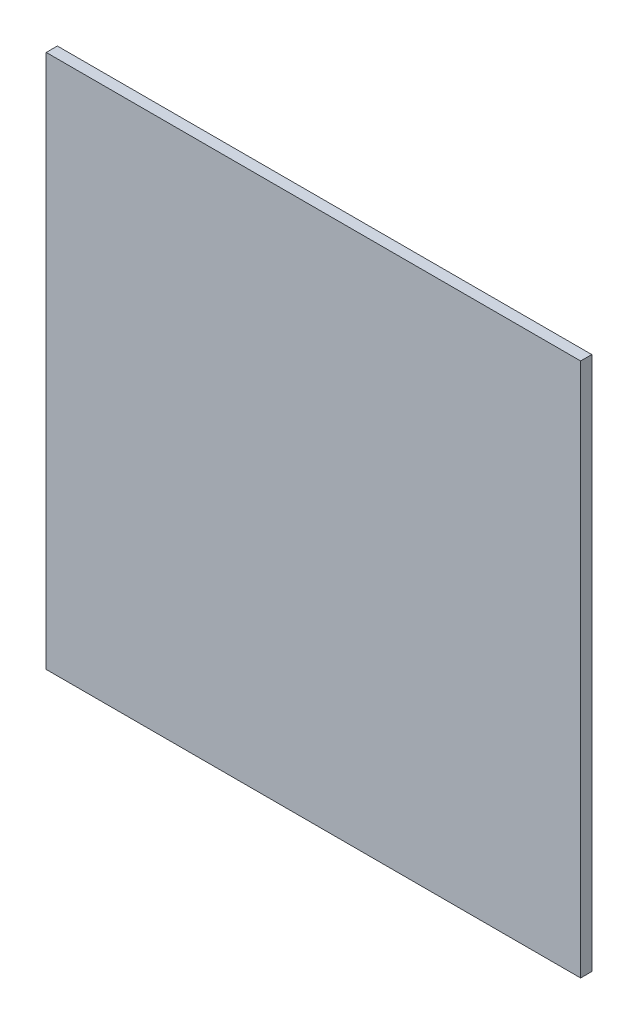
ISO-10303-21;
HEADER;
FILE_DESCRIPTION(('STEP AP214'),'2;1');
FILE_NAME('part.step','',(''),(''),'','','');
FILE_SCHEMA(('AUTOMOTIVE_DESIGN { 1 0 10303 214 1 1 1 1 }'));
ENDSEC;
DATA;
#1=APPLICATION_CONTEXT('core data for automotive mechanical design processes');
#2=APPLICATION_PROTOCOL_DEFINITION('international standard','automotive_design',2000,#1);
#3=PRODUCT_CONTEXT('',#1,'mechanical');
#4=PRODUCT('Part','Part','',(#3));
#5=PRODUCT_RELATED_PRODUCT_CATEGORY('part','',(#4));
#6=PRODUCT_DEFINITION_FORMATION('','',#4);
#7=PRODUCT_DEFINITION_CONTEXT('part definition',#1,'design');
#8=PRODUCT_DEFINITION('design','',#6,#7);
#9=PRODUCT_DEFINITION_SHAPE('','',#8);
#10=(LENGTH_UNIT() NAMED_UNIT(*) SI_UNIT(.MILLI.,.METRE.));
#11=(NAMED_UNIT(*) PLANE_ANGLE_UNIT() SI_UNIT($,.RADIAN.));
#12=(NAMED_UNIT(*) SI_UNIT($,.STERADIAN.) SOLID_ANGLE_UNIT());
#13=UNCERTAINTY_MEASURE_WITH_UNIT(LENGTH_MEASURE(1.E-05),#10,'distance_accuracy_value','');
#14=(GEOMETRIC_REPRESENTATION_CONTEXT(3) GLOBAL_UNCERTAINTY_ASSIGNED_CONTEXT((#13)) GLOBAL_UNIT_ASSIGNED_CONTEXT((#10,
#11,#12)) REPRESENTATION_CONTEXT('',''));
#15=CARTESIAN_POINT('',(0.,0.,0.));
#16=DIRECTION('',(0.,0.,1.));
#17=DIRECTION('',(1.,0.,0.));
#18=AXIS2_PLACEMENT_3D('',#15,#16,#17);
#19=CARTESIAN_POINT('',(0.,0.,25.4));
#20=DIRECTION('',(1.,0.,0.));
#21=DIRECTION('',(0.,0.,-1.));
#22=AXIS2_PLACEMENT_3D('',#19,#20,#21);
#23=PLANE('',#22);
#24=DIRECTION('',(0.,-1.,0.));
#25=VECTOR('',#24,1.);
#26=CARTESIAN_POINT('',(0.,0.,0.));
#27=LINE('',#26,#25);
#28=CARTESIAN_POINT('',(0.,0.,0.));
#29=VERTEX_POINT('',#28);
#30=CARTESIAN_POINT('',(0.,-1219.2,0.));
#31=VERTEX_POINT('',#30);
#32=EDGE_CURVE('E96',#29,#31,#27,.T.);
#33=ORIENTED_EDGE('',*,*,#32,.T.);
#34=DIRECTION('',(0.,0.,-1.));
#35=VECTOR('',#34,1.);
#36=CARTESIAN_POINT('',(0.,-1219.2,25.4));
#37=LINE('',#36,#35);
#38=CARTESIAN_POINT('',(0.,-1219.2,25.4));
#39=VERTEX_POINT('',#38);
#40=EDGE_CURVE('E11',#39,#31,#37,.T.);
#41=ORIENTED_EDGE('',*,*,#40,.F.);
#42=DIRECTION('',(0.,-1.,0.));
#43=VECTOR('',#42,1.);
#44=CARTESIAN_POINT('',(0.,0.,25.4));
#45=LINE('',#44,#43);
#46=CARTESIAN_POINT('',(0.,0.,25.4));
#47=VERTEX_POINT('',#46);
#48=EDGE_CURVE('E84',#47,#39,#45,.T.);
#49=ORIENTED_EDGE('',*,*,#48,.F.);
#50=DIRECTION('',(0.,0.,-1.));
#51=VECTOR('',#50,1.);
#52=CARTESIAN_POINT('',(0.,0.,25.4));
#53=LINE('',#52,#51);
#54=EDGE_CURVE('E92',#47,#29,#53,.T.);
#55=ORIENTED_EDGE('',*,*,#54,.T.);
#56=EDGE_LOOP('',(#33,#41,#49,#55));
#57=FACE_BOUND('',#56,.T.);
#58=ADVANCED_FACE('F33',(#57),#23,.F.);
#59=CARTESIAN_POINT('',(0.,-1219.2,25.4));
#60=DIRECTION('',(0.,1.,0.));
#61=DIRECTION('',(0.,0.,1.));
#62=AXIS2_PLACEMENT_3D('',#59,#60,#61);
#63=PLANE('',#62);
#64=DIRECTION('',(1.,0.,0.));
#65=VECTOR('',#64,1.);
#66=CARTESIAN_POINT('',(0.,-1219.2,0.));
#67=LINE('',#66,#65);
#68=CARTESIAN_POINT('',(1219.2,-1219.2,0.));
#69=VERTEX_POINT('',#68);
#70=EDGE_CURVE('E88',#31,#69,#67,.T.);
#71=ORIENTED_EDGE('',*,*,#70,.T.);
#72=DIRECTION('',(0.,0.,-1.));
#73=VECTOR('',#72,1.);
#74=CARTESIAN_POINT('',(1219.2,-1219.2,25.4));
#75=LINE('',#74,#73);
#76=CARTESIAN_POINT('',(1219.2,-1219.2,25.4));
#77=VERTEX_POINT('',#76);
#78=EDGE_CURVE('E41',#77,#69,#75,.T.);
#79=ORIENTED_EDGE('',*,*,#78,.F.);
#80=DIRECTION('',(1.,0.,0.));
#81=VECTOR('',#80,1.);
#82=CARTESIAN_POINT('',(0.,-1219.2,25.4));
#83=LINE('',#82,#81);
#84=EDGE_CURVE('E79',#39,#77,#83,.T.);
#85=ORIENTED_EDGE('',*,*,#84,.F.);
#86=ORIENTED_EDGE('',*,*,#40,.T.);
#87=EDGE_LOOP('',(#71,#79,#85,#86));
#88=FACE_BOUND('',#87,.T.);
#89=ADVANCED_FACE('F87',(#88),#63,.F.);
#90=CARTESIAN_POINT('',(1219.2,0.,25.4));
#91=DIRECTION('',(-1.,0.,0.));
#92=DIRECTION('',(0.,-1.,0.));
#93=AXIS2_PLACEMENT_3D('',#90,#91,#92);
#94=PLANE('',#93);
#95=DIRECTION('',(0.,1.,0.));
#96=VECTOR('',#95,1.);
#97=CARTESIAN_POINT('',(1219.2,0.,0.));
#98=LINE('',#97,#96);
#99=CARTESIAN_POINT('',(1219.2,0.,0.));
#100=VERTEX_POINT('',#99);
#101=EDGE_CURVE('E66',#69,#100,#98,.T.);
#102=ORIENTED_EDGE('',*,*,#101,.T.);
#103=DIRECTION('',(0.,0.,-1.));
#104=VECTOR('',#103,1.);
#105=CARTESIAN_POINT('',(1219.2,0.,25.4));
#106=LINE('',#105,#104);
#107=CARTESIAN_POINT('',(1219.2,0.,25.4));
#108=VERTEX_POINT('',#107);
#109=EDGE_CURVE('E89',#108,#100,#106,.T.);
#110=ORIENTED_EDGE('',*,*,#109,.F.);
#111=DIRECTION('',(0.,1.,0.));
#112=VECTOR('',#111,1.);
#113=CARTESIAN_POINT('',(1219.2,0.,25.4));
#114=LINE('',#113,#112);
#115=EDGE_CURVE('E82',#77,#108,#114,.T.);
#116=ORIENTED_EDGE('',*,*,#115,.F.);
#117=ORIENTED_EDGE('',*,*,#78,.T.);
#118=EDGE_LOOP('',(#102,#110,#116,#117));
#119=FACE_BOUND('',#118,.T.);
#120=ADVANCED_FACE('F90',(#119),#94,.F.);
#121=CARTESIAN_POINT('',(0.,0.,25.4));
#122=DIRECTION('',(0.,-1.,0.));
#123=DIRECTION('',(0.,0.,-1.));
#124=AXIS2_PLACEMENT_3D('',#121,#122,#123);
#125=PLANE('',#124);
#126=DIRECTION('',(-1.,0.,0.));
#127=VECTOR('',#126,1.);
#128=CARTESIAN_POINT('',(0.,0.,0.));
#129=LINE('',#128,#127);
#130=EDGE_CURVE('E72',#100,#29,#129,.T.);
#131=ORIENTED_EDGE('',*,*,#130,.T.);
#132=ORIENTED_EDGE('',*,*,#54,.F.);
#133=DIRECTION('',(-1.,0.,0.));
#134=VECTOR('',#133,1.);
#135=CARTESIAN_POINT('',(0.,0.,25.4));
#136=LINE('',#135,#134);
#137=EDGE_CURVE('E49',#108,#47,#136,.T.);
#138=ORIENTED_EDGE('',*,*,#137,.F.);
#139=ORIENTED_EDGE('',*,*,#109,.T.);
#140=EDGE_LOOP('',(#131,#132,#138,#139));
#141=FACE_BOUND('',#140,.T.);
#142=ADVANCED_FACE('F103',(#141),#125,.F.);
#143=CARTESIAN_POINT('',(0.,0.,25.4));
#144=DIRECTION('',(0.,0.,1.));
#145=DIRECTION('',(1.,0.,0.));
#146=AXIS2_PLACEMENT_3D('',#143,#144,#145);
#147=PLANE('',#146);
#148=ORIENTED_EDGE('',*,*,#48,.T.);
#149=ORIENTED_EDGE('',*,*,#84,.T.);
#150=ORIENTED_EDGE('',*,*,#115,.T.);
#151=ORIENTED_EDGE('',*,*,#137,.T.);
#152=EDGE_LOOP('',(#148,#149,#150,#151));
#153=FACE_BOUND('',#152,.T.);
#154=ADVANCED_FACE('F80',(#153),#147,.T.);
#155=CARTESIAN_POINT('',(0.,0.,0.));
#156=DIRECTION('',(0.,0.,1.));
#157=DIRECTION('',(1.,0.,0.));
#158=AXIS2_PLACEMENT_3D('',#155,#156,#157);
#159=PLANE('',#158);
#160=ORIENTED_EDGE('',*,*,#32,.F.);
#161=ORIENTED_EDGE('',*,*,#130,.F.);
#162=ORIENTED_EDGE('',*,*,#101,.F.);
#163=ORIENTED_EDGE('',*,*,#70,.F.);
#164=EDGE_LOOP('',(#160,#161,#162,#163));
#165=FACE_BOUND('',#164,.T.);
#166=ADVANCED_FACE('F106',(#165),#159,.F.);
#167=CLOSED_SHELL('',(#58,#89,#120,#142,#154,#166));
#168=MANIFOLD_SOLID_BREP('B2',#167);
#169=ADVANCED_BREP_SHAPE_REPRESENTATION('',(#18,#168),#14);
#170=SHAPE_DEFINITION_REPRESENTATION(#9,#169);
ENDSEC;
END-ISO-10303-21;
